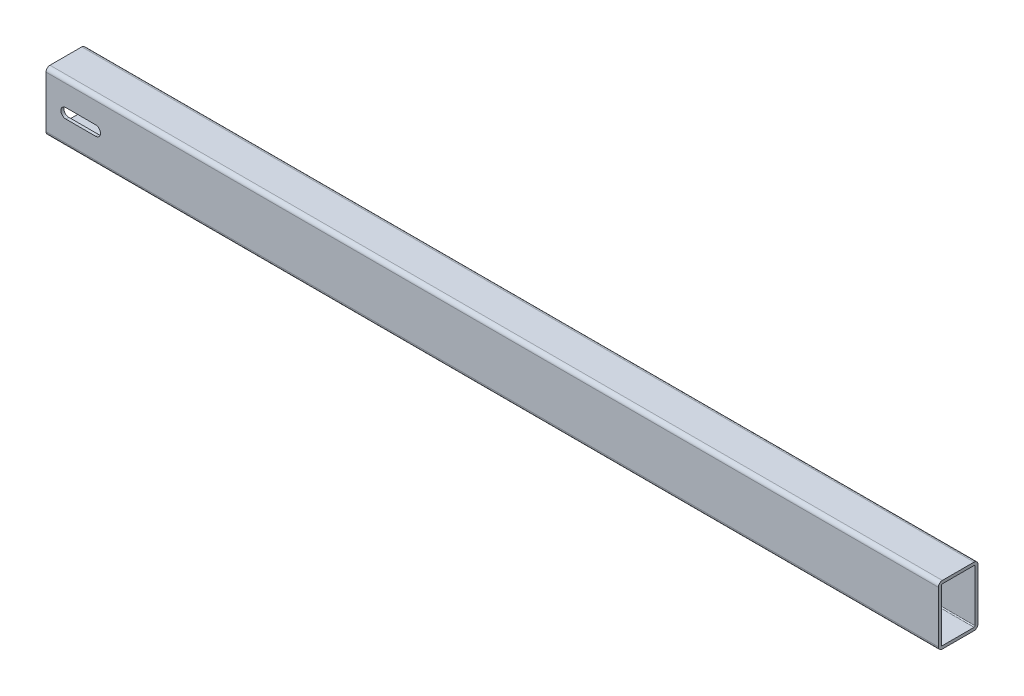
ISO-10303-21;
HEADER;
FILE_DESCRIPTION(('STEP AP214'),'2;1');
FILE_NAME('part.step','',(''),(''),'','','');
FILE_SCHEMA(('AUTOMOTIVE_DESIGN { 1 0 10303 214 1 1 1 1 }'));
ENDSEC;
DATA;
#1=APPLICATION_CONTEXT('core data for automotive mechanical design processes');
#2=APPLICATION_PROTOCOL_DEFINITION('international standard','automotive_design',2000,#1);
#3=PRODUCT_CONTEXT('',#1,'mechanical');
#4=PRODUCT('Part','Part','',(#3));
#5=PRODUCT_RELATED_PRODUCT_CATEGORY('part','',(#4));
#6=PRODUCT_DEFINITION_FORMATION('','',#4);
#7=PRODUCT_DEFINITION_CONTEXT('part definition',#1,'design');
#8=PRODUCT_DEFINITION('design','',#6,#7);
#9=PRODUCT_DEFINITION_SHAPE('','',#8);
#10=(LENGTH_UNIT() NAMED_UNIT(*) SI_UNIT(.MILLI.,.METRE.));
#11=(NAMED_UNIT(*) PLANE_ANGLE_UNIT() SI_UNIT($,.RADIAN.));
#12=(NAMED_UNIT(*) SI_UNIT($,.STERADIAN.) SOLID_ANGLE_UNIT());
#13=UNCERTAINTY_MEASURE_WITH_UNIT(LENGTH_MEASURE(1.E-05),#10,'distance_accuracy_value','');
#14=(GEOMETRIC_REPRESENTATION_CONTEXT(3) GLOBAL_UNCERTAINTY_ASSIGNED_CONTEXT((#13)) GLOBAL_UNIT_ASSIGNED_CONTEXT((#10,
#11,#12)) REPRESENTATION_CONTEXT('',''));
#15=CARTESIAN_POINT('',(0.,0.,0.));
#16=DIRECTION('',(0.,0.,1.));
#17=DIRECTION('',(1.,0.,0.));
#18=AXIS2_PLACEMENT_3D('',#15,#16,#17);
#19=CARTESIAN_POINT('',(900.,1.,-1.));
#20=DIRECTION('',(-1.,0.,0.));
#21=DIRECTION('',(0.,0.,1.));
#22=AXIS2_PLACEMENT_3D('',#19,#20,#21);
#23=PLANE('',#22);
#24=CARTESIAN_POINT('',(900.,1.,-1.));
#25=DIRECTION('',(-1.,0.,0.));
#26=DIRECTION('',(0.,0.,1.));
#27=AXIS2_PLACEMENT_3D('',#24,#25,#26);
#28=CIRCLE('',#27,4.);
#29=CARTESIAN_POINT('',(900.,1.,3.));
#30=VERTEX_POINT('',#29);
#31=CARTESIAN_POINT('',(900.,-3.,-1.));
#32=VERTEX_POINT('',#31);
#33=EDGE_CURVE('E358',#30,#32,#28,.F.);
#34=ORIENTED_EDGE('',*,*,#33,.T.);
#35=DIRECTION('',(0.,0.,-1.));
#36=VECTOR('',#35,1.);
#37=CARTESIAN_POINT('',(900.,-3.,-1.));
#38=LINE('',#37,#36);
#39=CARTESIAN_POINT('',(900.,-3.,-33.));
#40=VERTEX_POINT('',#39);
#41=EDGE_CURVE('E361',#32,#40,#38,.T.);
#42=ORIENTED_EDGE('',*,*,#41,.T.);
#43=CARTESIAN_POINT('',(900.,1.,-33.));
#44=DIRECTION('',(-1.,0.,0.));
#45=DIRECTION('',(0.,0.,1.));
#46=AXIS2_PLACEMENT_3D('',#43,#44,#45);
#47=CIRCLE('',#46,4.);
#48=CARTESIAN_POINT('',(900.,1.,-37.));
#49=VERTEX_POINT('',#48);
#50=EDGE_CURVE('E364',#40,#49,#47,.F.);
#51=ORIENTED_EDGE('',*,*,#50,.T.);
#52=DIRECTION('',(0.,1.,0.));
#53=VECTOR('',#52,1.);
#54=CARTESIAN_POINT('',(900.,1.,-37.));
#55=LINE('',#54,#53);
#56=CARTESIAN_POINT('',(900.,53.,-37.));
#57=VERTEX_POINT('',#56);
#58=EDGE_CURVE('E366',#49,#57,#55,.T.);
#59=ORIENTED_EDGE('',*,*,#58,.T.);
#60=CARTESIAN_POINT('',(900.,53.,-33.));
#61=DIRECTION('',(-1.,0.,0.));
#62=DIRECTION('',(0.,0.,1.));
#63=AXIS2_PLACEMENT_3D('',#60,#61,#62);
#64=CIRCLE('',#63,4.);
#65=CARTESIAN_POINT('',(900.,57.,-33.));
#66=VERTEX_POINT('',#65);
#67=EDGE_CURVE('E368',#57,#66,#64,.F.);
#68=ORIENTED_EDGE('',*,*,#67,.T.);
#69=DIRECTION('',(0.,0.,1.));
#70=VECTOR('',#69,1.);
#71=CARTESIAN_POINT('',(900.,57.,-1.));
#72=LINE('',#71,#70);
#73=CARTESIAN_POINT('',(900.,57.,-1.));
#74=VERTEX_POINT('',#73);
#75=EDGE_CURVE('E370',#66,#74,#72,.T.);
#76=ORIENTED_EDGE('',*,*,#75,.T.);
#77=CARTESIAN_POINT('',(900.,53.,-1.));
#78=DIRECTION('',(-1.,0.,0.));
#79=DIRECTION('',(0.,0.,1.));
#80=AXIS2_PLACEMENT_3D('',#77,#78,#79);
#81=CIRCLE('',#80,4.);
#82=CARTESIAN_POINT('',(900.,53.,3.));
#83=VERTEX_POINT('',#82);
#84=EDGE_CURVE('E372',#74,#83,#81,.F.);
#85=ORIENTED_EDGE('',*,*,#84,.T.);
#86=DIRECTION('',(0.,-1.,0.));
#87=VECTOR('',#86,1.);
#88=CARTESIAN_POINT('',(900.,1.,3.));
#89=LINE('',#88,#87);
#90=EDGE_CURVE('E374',#83,#30,#89,.T.);
#91=ORIENTED_EDGE('',*,*,#90,.T.);
#92=EDGE_LOOP('',(#34,#42,#51,#59,#68,#76,#85,#91));
#93=FACE_BOUND('',#92,.T.);
#94=CARTESIAN_POINT('',(900.,1.,-1.));
#95=DIRECTION('',(1.,0.,0.));
#96=DIRECTION('',(0.,0.,1.));
#97=AXIS2_PLACEMENT_3D('',#94,#95,#96);
#98=CIRCLE('',#97,1.);
#99=CARTESIAN_POINT('',(900.,1.,0.));
#100=VERTEX_POINT('',#99);
#101=CARTESIAN_POINT('',(900.,0.,-1.));
#102=VERTEX_POINT('',#101);
#103=EDGE_CURVE('E299',#100,#102,#98,.T.);
#104=ORIENTED_EDGE('',*,*,#103,.F.);
#105=DIRECTION('',(0.,-1.,0.));
#106=VECTOR('',#105,1.);
#107=CARTESIAN_POINT('',(900.,1.,0.));
#108=LINE('',#107,#106);
#109=CARTESIAN_POINT('',(900.,53.,0.));
#110=VERTEX_POINT('',#109);
#111=EDGE_CURVE('E315',#110,#100,#108,.T.);
#112=ORIENTED_EDGE('',*,*,#111,.F.);
#113=CARTESIAN_POINT('',(900.,53.,-1.));
#114=DIRECTION('',(1.,0.,0.));
#115=DIRECTION('',(0.,0.,1.));
#116=AXIS2_PLACEMENT_3D('',#113,#114,#115);
#117=CIRCLE('',#116,1.);
#118=CARTESIAN_POINT('',(900.,54.,-1.));
#119=VERTEX_POINT('',#118);
#120=EDGE_CURVE('E312',#119,#110,#117,.T.);
#121=ORIENTED_EDGE('',*,*,#120,.F.);
#122=DIRECTION('',(0.,0.,1.));
#123=VECTOR('',#122,1.);
#124=CARTESIAN_POINT('',(900.,54.,-1.));
#125=LINE('',#124,#123);
#126=CARTESIAN_POINT('',(900.,54.,-33.));
#127=VERTEX_POINT('',#126);
#128=EDGE_CURVE('E310',#127,#119,#125,.T.);
#129=ORIENTED_EDGE('',*,*,#128,.F.);
#130=CARTESIAN_POINT('',(900.,53.,-33.));
#131=DIRECTION('',(1.,0.,0.));
#132=DIRECTION('',(0.,0.,-1.));
#133=AXIS2_PLACEMENT_3D('',#130,#131,#132);
#134=CIRCLE('',#133,1.);
#135=CARTESIAN_POINT('',(900.,53.,-34.));
#136=VERTEX_POINT('',#135);
#137=EDGE_CURVE('E308',#136,#127,#134,.T.);
#138=ORIENTED_EDGE('',*,*,#137,.F.);
#139=DIRECTION('',(0.,1.,0.));
#140=VECTOR('',#139,1.);
#141=CARTESIAN_POINT('',(900.,1.,-34.));
#142=LINE('',#141,#140);
#143=CARTESIAN_POINT('',(900.,1.,-34.));
#144=VERTEX_POINT('',#143);
#145=EDGE_CURVE('E306',#144,#136,#142,.T.);
#146=ORIENTED_EDGE('',*,*,#145,.F.);
#147=CARTESIAN_POINT('',(900.,1.,-33.));
#148=DIRECTION('',(1.,0.,0.));
#149=DIRECTION('',(0.,0.,-1.));
#150=AXIS2_PLACEMENT_3D('',#147,#148,#149);
#151=CIRCLE('',#150,1.);
#152=CARTESIAN_POINT('',(900.,0.,-33.));
#153=VERTEX_POINT('',#152);
#154=EDGE_CURVE('E304',#153,#144,#151,.T.);
#155=ORIENTED_EDGE('',*,*,#154,.F.);
#156=DIRECTION('',(0.,0.,-1.));
#157=VECTOR('',#156,1.);
#158=CARTESIAN_POINT('',(900.,0.,-1.));
#159=LINE('',#158,#157);
#160=EDGE_CURVE('E301',#102,#153,#159,.T.);
#161=ORIENTED_EDGE('',*,*,#160,.F.);
#162=EDGE_LOOP('',(#104,#112,#121,#129,#138,#146,#155,#161));
#163=FACE_BOUND('',#162,.T.);
#164=ADVANCED_FACE('F83',(#93,#163),#23,.F.);
#165=CARTESIAN_POINT('',(0.,1.,-1.));
#166=DIRECTION('',(-1.,0.,0.));
#167=DIRECTION('',(0.,0.,1.));
#168=AXIS2_PLACEMENT_3D('',#165,#166,#167);
#169=PLANE('',#168);
#170=CARTESIAN_POINT('',(0.,1.,-1.));
#171=DIRECTION('',(-1.,0.,0.));
#172=DIRECTION('',(0.,0.,1.));
#173=AXIS2_PLACEMENT_3D('',#170,#171,#172);
#174=CIRCLE('',#173,4.);
#175=CARTESIAN_POINT('',(0.,1.,3.));
#176=VERTEX_POINT('',#175);
#177=CARTESIAN_POINT('',(0.,-3.,-1.));
#178=VERTEX_POINT('',#177);
#179=EDGE_CURVE('E357',#176,#178,#174,.F.);
#180=ORIENTED_EDGE('',*,*,#179,.F.);
#181=DIRECTION('',(0.,-1.,0.));
#182=VECTOR('',#181,1.);
#183=CARTESIAN_POINT('',(0.,1.,3.));
#184=LINE('',#183,#182);
#185=CARTESIAN_POINT('',(0.,53.,3.));
#186=VERTEX_POINT('',#185);
#187=EDGE_CURVE('E362',#186,#176,#184,.T.);
#188=ORIENTED_EDGE('',*,*,#187,.F.);
#189=CARTESIAN_POINT('',(0.,53.,-1.));
#190=DIRECTION('',(-1.,0.,0.));
#191=DIRECTION('',(0.,0.,1.));
#192=AXIS2_PLACEMENT_3D('',#189,#190,#191);
#193=CIRCLE('',#192,4.);
#194=CARTESIAN_POINT('',(0.,57.,-1.));
#195=VERTEX_POINT('',#194);
#196=EDGE_CURVE('E389',#195,#186,#193,.F.);
#197=ORIENTED_EDGE('',*,*,#196,.F.);
#198=DIRECTION('',(0.,0.,1.));
#199=VECTOR('',#198,1.);
#200=CARTESIAN_POINT('',(0.,57.,-1.));
#201=LINE('',#200,#199);
#202=CARTESIAN_POINT('',(0.,57.,-33.));
#203=VERTEX_POINT('',#202);
#204=EDGE_CURVE('E387',#203,#195,#201,.T.);
#205=ORIENTED_EDGE('',*,*,#204,.F.);
#206=CARTESIAN_POINT('',(0.,53.,-33.));
#207=DIRECTION('',(-1.,0.,0.));
#208=DIRECTION('',(0.,0.,1.));
#209=AXIS2_PLACEMENT_3D('',#206,#207,#208);
#210=CIRCLE('',#209,4.);
#211=CARTESIAN_POINT('',(0.,53.,-37.));
#212=VERTEX_POINT('',#211);
#213=EDGE_CURVE('E385',#212,#203,#210,.F.);
#214=ORIENTED_EDGE('',*,*,#213,.F.);
#215=DIRECTION('',(0.,1.,0.));
#216=VECTOR('',#215,1.);
#217=CARTESIAN_POINT('',(0.,1.,-37.));
#218=LINE('',#217,#216);
#219=CARTESIAN_POINT('',(0.,1.,-37.));
#220=VERTEX_POINT('',#219);
#221=EDGE_CURVE('E383',#220,#212,#218,.T.);
#222=ORIENTED_EDGE('',*,*,#221,.F.);
#223=CARTESIAN_POINT('',(0.,1.,-33.));
#224=DIRECTION('',(-1.,0.,0.));
#225=DIRECTION('',(0.,0.,1.));
#226=AXIS2_PLACEMENT_3D('',#223,#224,#225);
#227=CIRCLE('',#226,4.);
#228=CARTESIAN_POINT('',(0.,-3.,-33.));
#229=VERTEX_POINT('',#228);
#230=EDGE_CURVE('E381',#229,#220,#227,.F.);
#231=ORIENTED_EDGE('',*,*,#230,.F.);
#232=DIRECTION('',(0.,0.,-1.));
#233=VECTOR('',#232,1.);
#234=CARTESIAN_POINT('',(0.,-3.,-1.));
#235=LINE('',#234,#233);
#236=EDGE_CURVE('E379',#178,#229,#235,.T.);
#237=ORIENTED_EDGE('',*,*,#236,.F.);
#238=EDGE_LOOP('',(#180,#188,#197,#205,#214,#222,#231,#237));
#239=FACE_BOUND('',#238,.T.);
#240=DIRECTION('',(0.,-1.,0.));
#241=VECTOR('',#240,1.);
#242=CARTESIAN_POINT('',(0.,1.,0.));
#243=LINE('',#242,#241);
#244=CARTESIAN_POINT('',(0.,53.,0.));
#245=VERTEX_POINT('',#244);
#246=CARTESIAN_POINT('',(0.,1.,0.));
#247=VERTEX_POINT('',#246);
#248=EDGE_CURVE('E302',#245,#247,#243,.T.);
#249=ORIENTED_EDGE('',*,*,#248,.T.);
#250=CARTESIAN_POINT('',(0.,1.,-1.));
#251=DIRECTION('',(1.,0.,0.));
#252=DIRECTION('',(0.,0.,1.));
#253=AXIS2_PLACEMENT_3D('',#250,#251,#252);
#254=CIRCLE('',#253,1.);
#255=CARTESIAN_POINT('',(0.,0.,-1.));
#256=VERTEX_POINT('',#255);
#257=EDGE_CURVE('E298',#247,#256,#254,.T.);
#258=ORIENTED_EDGE('',*,*,#257,.T.);
#259=DIRECTION('',(0.,0.,-1.));
#260=VECTOR('',#259,1.);
#261=CARTESIAN_POINT('',(0.,0.,-1.));
#262=LINE('',#261,#260);
#263=CARTESIAN_POINT('',(0.,0.,-33.));
#264=VERTEX_POINT('',#263);
#265=EDGE_CURVE('E320',#256,#264,#262,.T.);
#266=ORIENTED_EDGE('',*,*,#265,.T.);
#267=CARTESIAN_POINT('',(0.,1.,-33.));
#268=DIRECTION('',(1.,0.,0.));
#269=DIRECTION('',(0.,0.,-1.));
#270=AXIS2_PLACEMENT_3D('',#267,#268,#269);
#271=CIRCLE('',#270,1.);
#272=CARTESIAN_POINT('',(0.,1.,-34.));
#273=VERTEX_POINT('',#272);
#274=EDGE_CURVE('E323',#264,#273,#271,.T.);
#275=ORIENTED_EDGE('',*,*,#274,.T.);
#276=DIRECTION('',(0.,1.,0.));
#277=VECTOR('',#276,1.);
#278=CARTESIAN_POINT('',(0.,1.,-34.));
#279=LINE('',#278,#277);
#280=CARTESIAN_POINT('',(0.,53.,-34.));
#281=VERTEX_POINT('',#280);
#282=EDGE_CURVE('E326',#273,#281,#279,.T.);
#283=ORIENTED_EDGE('',*,*,#282,.T.);
#284=CARTESIAN_POINT('',(0.,53.,-33.));
#285=DIRECTION('',(1.,0.,0.));
#286=DIRECTION('',(0.,0.,-1.));
#287=AXIS2_PLACEMENT_3D('',#284,#285,#286);
#288=CIRCLE('',#287,1.);
#289=CARTESIAN_POINT('',(0.,54.,-33.));
#290=VERTEX_POINT('',#289);
#291=EDGE_CURVE('E329',#281,#290,#288,.T.);
#292=ORIENTED_EDGE('',*,*,#291,.T.);
#293=DIRECTION('',(0.,0.,1.));
#294=VECTOR('',#293,1.);
#295=CARTESIAN_POINT('',(0.,54.,-1.));
#296=LINE('',#295,#294);
#297=CARTESIAN_POINT('',(0.,54.,-1.));
#298=VERTEX_POINT('',#297);
#299=EDGE_CURVE('E332',#290,#298,#296,.T.);
#300=ORIENTED_EDGE('',*,*,#299,.T.);
#301=CARTESIAN_POINT('',(0.,53.,-1.));
#302=DIRECTION('',(1.,0.,0.));
#303=DIRECTION('',(0.,0.,1.));
#304=AXIS2_PLACEMENT_3D('',#301,#302,#303);
#305=CIRCLE('',#304,1.);
#306=EDGE_CURVE('E335',#298,#245,#305,.T.);
#307=ORIENTED_EDGE('',*,*,#306,.T.);
#308=EDGE_LOOP('',(#249,#258,#266,#275,#283,#292,#300,#307));
#309=FACE_BOUND('',#308,.T.);
#310=ADVANCED_FACE('F455',(#239,#309),#169,.T.);
#311=CARTESIAN_POINT('',(900.,1.,-1.));
#312=DIRECTION('',(-1.,0.,0.));
#313=DIRECTION('',(0.,0.,1.));
#314=AXIS2_PLACEMENT_3D('',#311,#312,#313);
#315=CYLINDRICAL_SURFACE('',#314,4.);
#316=ORIENTED_EDGE('',*,*,#179,.T.);
#317=DIRECTION('',(-1.,0.,0.));
#318=VECTOR('',#317,1.);
#319=CARTESIAN_POINT('',(900.,-3.,-1.));
#320=LINE('',#319,#318);
#321=EDGE_CURVE('E412',#32,#178,#320,.T.);
#322=ORIENTED_EDGE('',*,*,#321,.F.);
#323=ORIENTED_EDGE('',*,*,#33,.F.);
#324=DIRECTION('',(-1.,0.,0.));
#325=VECTOR('',#324,1.);
#326=CARTESIAN_POINT('',(900.,1.,3.));
#327=LINE('',#326,#325);
#328=EDGE_CURVE('E376',#30,#176,#327,.T.);
#329=ORIENTED_EDGE('',*,*,#328,.T.);
#330=EDGE_LOOP('',(#316,#322,#323,#329));
#331=FACE_BOUND('',#330,.T.);
#332=ADVANCED_FACE('F85',(#331),#315,.T.);
#333=CARTESIAN_POINT('',(900.,-3.,-1.));
#334=DIRECTION('',(0.,1.,0.));
#335=DIRECTION('',(0.,0.,1.));
#336=AXIS2_PLACEMENT_3D('',#333,#334,#335);
#337=PLANE('',#336);
#338=ORIENTED_EDGE('',*,*,#236,.T.);
#339=DIRECTION('',(-1.,0.,0.));
#340=VECTOR('',#339,1.);
#341=CARTESIAN_POINT('',(900.,-3.,-33.));
#342=LINE('',#341,#340);
#343=EDGE_CURVE('E409',#40,#229,#342,.T.);
#344=ORIENTED_EDGE('',*,*,#343,.F.);
#345=ORIENTED_EDGE('',*,*,#41,.F.);
#346=ORIENTED_EDGE('',*,*,#321,.T.);
#347=EDGE_LOOP('',(#338,#344,#345,#346));
#348=FACE_BOUND('',#347,.T.);
#349=ADVANCED_FACE('F461',(#348),#337,.F.);
#350=CARTESIAN_POINT('',(900.,1.,-33.));
#351=DIRECTION('',(-1.,0.,0.));
#352=DIRECTION('',(0.,0.,1.));
#353=AXIS2_PLACEMENT_3D('',#350,#351,#352);
#354=CYLINDRICAL_SURFACE('',#353,4.);
#355=ORIENTED_EDGE('',*,*,#230,.T.);
#356=DIRECTION('',(-1.,0.,0.));
#357=VECTOR('',#356,1.);
#358=CARTESIAN_POINT('',(900.,1.,-37.));
#359=LINE('',#358,#357);
#360=EDGE_CURVE('E406',#49,#220,#359,.T.);
#361=ORIENTED_EDGE('',*,*,#360,.F.);
#362=ORIENTED_EDGE('',*,*,#50,.F.);
#363=ORIENTED_EDGE('',*,*,#343,.T.);
#364=EDGE_LOOP('',(#355,#361,#362,#363));
#365=FACE_BOUND('',#364,.T.);
#366=ADVANCED_FACE('F481',(#365),#354,.T.);
#367=CARTESIAN_POINT('',(900.,1.,-37.));
#368=DIRECTION('',(0.,0.,1.));
#369=DIRECTION('',(1.,0.,0.));
#370=AXIS2_PLACEMENT_3D('',#367,#368,#369);
#371=PLANE('',#370);
#372=DIRECTION('',(-1.,0.,0.));
#373=VECTOR('',#372,1.);
#374=CARTESIAN_POINT('',(20.,32.,-37.));
#375=LINE('',#374,#373);
#376=CARTESIAN_POINT('',(50.,32.,-37.));
#377=VERTEX_POINT('',#376);
#378=CARTESIAN_POINT('',(20.,32.,-37.));
#379=VERTEX_POINT('',#378);
#380=EDGE_CURVE('E268',#377,#379,#375,.T.);
#381=ORIENTED_EDGE('',*,*,#380,.T.);
#382=CARTESIAN_POINT('',(20.,27.,-37.));
#383=DIRECTION('',(0.,0.,1.));
#384=DIRECTION('',(-1.,0.,0.));
#385=AXIS2_PLACEMENT_3D('',#382,#383,#384);
#386=CIRCLE('',#385,5.);
#387=CARTESIAN_POINT('',(20.,22.,-37.));
#388=VERTEX_POINT('',#387);
#389=EDGE_CURVE('E250',#379,#388,#386,.T.);
#390=ORIENTED_EDGE('',*,*,#389,.T.);
#391=DIRECTION('',(1.,0.,0.));
#392=VECTOR('',#391,1.);
#393=CARTESIAN_POINT('',(20.,22.,-37.));
#394=LINE('',#393,#392);
#395=CARTESIAN_POINT('',(49.9999999999999,22.,-37.));
#396=VERTEX_POINT('',#395);
#397=EDGE_CURVE('E260',#388,#396,#394,.T.);
#398=ORIENTED_EDGE('',*,*,#397,.T.);
#399=CARTESIAN_POINT('',(50.,27.,-37.));
#400=DIRECTION('',(0.,0.,1.));
#401=DIRECTION('',(-1.,0.,0.));
#402=AXIS2_PLACEMENT_3D('',#399,#400,#401);
#403=CIRCLE('',#402,5.);
#404=EDGE_CURVE('E98',#396,#377,#403,.T.);
#405=ORIENTED_EDGE('',*,*,#404,.T.);
#406=EDGE_LOOP('',(#381,#390,#398,#405));
#407=FACE_BOUND('',#406,.T.);
#408=ORIENTED_EDGE('',*,*,#221,.T.);
#409=DIRECTION('',(-1.,0.,0.));
#410=VECTOR('',#409,1.);
#411=CARTESIAN_POINT('',(900.,53.,-37.));
#412=LINE('',#411,#410);
#413=EDGE_CURVE('E403',#57,#212,#412,.T.);
#414=ORIENTED_EDGE('',*,*,#413,.F.);
#415=ORIENTED_EDGE('',*,*,#58,.F.);
#416=ORIENTED_EDGE('',*,*,#360,.T.);
#417=EDGE_LOOP('',(#408,#414,#415,#416));
#418=FACE_BOUND('',#417,.T.);
#419=ADVANCED_FACE('F265',(#407,#418),#371,.F.);
#420=CARTESIAN_POINT('',(900.,53.,-33.));
#421=DIRECTION('',(-1.,0.,0.));
#422=DIRECTION('',(0.,0.,1.));
#423=AXIS2_PLACEMENT_3D('',#420,#421,#422);
#424=CYLINDRICAL_SURFACE('',#423,4.);
#425=ORIENTED_EDGE('',*,*,#213,.T.);
#426=DIRECTION('',(-1.,0.,0.));
#427=VECTOR('',#426,1.);
#428=CARTESIAN_POINT('',(900.,57.,-33.));
#429=LINE('',#428,#427);
#430=EDGE_CURVE('E400',#66,#203,#429,.T.);
#431=ORIENTED_EDGE('',*,*,#430,.F.);
#432=ORIENTED_EDGE('',*,*,#67,.F.);
#433=ORIENTED_EDGE('',*,*,#413,.T.);
#434=EDGE_LOOP('',(#425,#431,#432,#433));
#435=FACE_BOUND('',#434,.T.);
#436=ADVANCED_FACE('F476',(#435),#424,.T.);
#437=CARTESIAN_POINT('',(900.,57.,-1.));
#438=DIRECTION('',(0.,-1.,0.));
#439=DIRECTION('',(0.,0.,-1.));
#440=AXIS2_PLACEMENT_3D('',#437,#438,#439);
#441=PLANE('',#440);
#442=ORIENTED_EDGE('',*,*,#204,.T.);
#443=DIRECTION('',(-1.,0.,0.));
#444=VECTOR('',#443,1.);
#445=CARTESIAN_POINT('',(900.,57.,-1.));
#446=LINE('',#445,#444);
#447=EDGE_CURVE('E397',#74,#195,#446,.T.);
#448=ORIENTED_EDGE('',*,*,#447,.F.);
#449=ORIENTED_EDGE('',*,*,#75,.F.);
#450=ORIENTED_EDGE('',*,*,#430,.T.);
#451=EDGE_LOOP('',(#442,#448,#449,#450));
#452=FACE_BOUND('',#451,.T.);
#453=ADVANCED_FACE('F472',(#452),#441,.F.);
#454=CARTESIAN_POINT('',(900.,53.,-1.));
#455=DIRECTION('',(-1.,0.,0.));
#456=DIRECTION('',(0.,0.,1.));
#457=AXIS2_PLACEMENT_3D('',#454,#455,#456);
#458=CYLINDRICAL_SURFACE('',#457,4.);
#459=ORIENTED_EDGE('',*,*,#196,.T.);
#460=DIRECTION('',(-1.,0.,0.));
#461=VECTOR('',#460,1.);
#462=CARTESIAN_POINT('',(900.,53.,3.));
#463=LINE('',#462,#461);
#464=EDGE_CURVE('E394',#83,#186,#463,.T.);
#465=ORIENTED_EDGE('',*,*,#464,.F.);
#466=ORIENTED_EDGE('',*,*,#84,.F.);
#467=ORIENTED_EDGE('',*,*,#447,.T.);
#468=EDGE_LOOP('',(#459,#465,#466,#467));
#469=FACE_BOUND('',#468,.T.);
#470=ADVANCED_FACE('F443',(#469),#458,.T.);
#471=CARTESIAN_POINT('',(900.,1.,3.));
#472=DIRECTION('',(0.,0.,-1.));
#473=DIRECTION('',(-1.,0.,0.));
#474=AXIS2_PLACEMENT_3D('',#471,#472,#473);
#475=PLANE('',#474);
#476=DIRECTION('',(1.,0.,0.));
#477=VECTOR('',#476,1.);
#478=CARTESIAN_POINT('',(20.,22.,3.));
#479=LINE('',#478,#477);
#480=CARTESIAN_POINT('',(20.,22.,3.));
#481=VERTEX_POINT('',#480);
#482=CARTESIAN_POINT('',(50.,22.,3.));
#483=VERTEX_POINT('',#482);
#484=EDGE_CURVE('E278',#481,#483,#479,.T.);
#485=ORIENTED_EDGE('',*,*,#484,.F.);
#486=CARTESIAN_POINT('',(20.,27.,3.));
#487=DIRECTION('',(0.,0.,1.));
#488=DIRECTION('',(-1.,0.,0.));
#489=AXIS2_PLACEMENT_3D('',#486,#487,#488);
#490=CIRCLE('',#489,5.);
#491=CARTESIAN_POINT('',(20.,32.,3.));
#492=VERTEX_POINT('',#491);
#493=EDGE_CURVE('E106',#492,#481,#490,.T.);
#494=ORIENTED_EDGE('',*,*,#493,.F.);
#495=DIRECTION('',(-1.,0.,0.));
#496=VECTOR('',#495,1.);
#497=CARTESIAN_POINT('',(20.,32.,3.));
#498=LINE('',#497,#496);
#499=CARTESIAN_POINT('',(50.,32.,3.));
#500=VERTEX_POINT('',#499);
#501=EDGE_CURVE('E269',#500,#492,#498,.T.);
#502=ORIENTED_EDGE('',*,*,#501,.F.);
#503=CARTESIAN_POINT('',(50.,27.,3.));
#504=DIRECTION('',(0.,0.,1.));
#505=DIRECTION('',(-1.,0.,0.));
#506=AXIS2_PLACEMENT_3D('',#503,#504,#505);
#507=CIRCLE('',#506,5.);
#508=EDGE_CURVE('E272',#483,#500,#507,.T.);
#509=ORIENTED_EDGE('',*,*,#508,.F.);
#510=EDGE_LOOP('',(#485,#494,#502,#509));
#511=FACE_BOUND('',#510,.T.);
#512=ORIENTED_EDGE('',*,*,#187,.T.);
#513=ORIENTED_EDGE('',*,*,#328,.F.);
#514=ORIENTED_EDGE('',*,*,#90,.F.);
#515=ORIENTED_EDGE('',*,*,#464,.T.);
#516=EDGE_LOOP('',(#512,#513,#514,#515));
#517=FACE_BOUND('',#516,.T.);
#518=ADVANCED_FACE('F439',(#511,#517),#475,.F.);
#519=CARTESIAN_POINT('',(900.,1.,-1.));
#520=DIRECTION('',(-1.,0.,0.));
#521=DIRECTION('',(0.,0.,1.));
#522=AXIS2_PLACEMENT_3D('',#519,#520,#521);
#523=CYLINDRICAL_SURFACE('',#522,1.);
#524=ORIENTED_EDGE('',*,*,#257,.F.);
#525=DIRECTION('',(-1.,0.,0.));
#526=VECTOR('',#525,1.);
#527=CARTESIAN_POINT('',(900.,1.,0.));
#528=LINE('',#527,#526);
#529=EDGE_CURVE('E317',#100,#247,#528,.T.);
#530=ORIENTED_EDGE('',*,*,#529,.F.);
#531=ORIENTED_EDGE('',*,*,#103,.T.);
#532=DIRECTION('',(-1.,0.,0.));
#533=VECTOR('',#532,1.);
#534=CARTESIAN_POINT('',(900.,0.,-1.));
#535=LINE('',#534,#533);
#536=EDGE_CURVE('E354',#102,#256,#535,.T.);
#537=ORIENTED_EDGE('',*,*,#536,.T.);
#538=EDGE_LOOP('',(#524,#530,#531,#537));
#539=FACE_BOUND('',#538,.T.);
#540=ADVANCED_FACE('F442',(#539),#523,.F.);
#541=CARTESIAN_POINT('',(900.,0.,-1.));
#542=DIRECTION('',(0.,1.,0.));
#543=DIRECTION('',(0.,0.,1.));
#544=AXIS2_PLACEMENT_3D('',#541,#542,#543);
#545=PLANE('',#544);
#546=ORIENTED_EDGE('',*,*,#265,.F.);
#547=ORIENTED_EDGE('',*,*,#536,.F.);
#548=ORIENTED_EDGE('',*,*,#160,.T.);
#549=DIRECTION('',(-1.,0.,0.));
#550=VECTOR('',#549,1.);
#551=CARTESIAN_POINT('',(900.,0.,-33.));
#552=LINE('',#551,#550);
#553=EDGE_CURVE('E352',#153,#264,#552,.T.);
#554=ORIENTED_EDGE('',*,*,#553,.T.);
#555=EDGE_LOOP('',(#546,#547,#548,#554));
#556=FACE_BOUND('',#555,.T.);
#557=ADVANCED_FACE('F526',(#556),#545,.T.);
#558=CARTESIAN_POINT('',(900.,1.,-33.));
#559=DIRECTION('',(-1.,0.,0.));
#560=DIRECTION('',(0.,0.,1.));
#561=AXIS2_PLACEMENT_3D('',#558,#559,#560);
#562=CYLINDRICAL_SURFACE('',#561,1.);
#563=ORIENTED_EDGE('',*,*,#274,.F.);
#564=ORIENTED_EDGE('',*,*,#553,.F.);
#565=ORIENTED_EDGE('',*,*,#154,.T.);
#566=DIRECTION('',(-1.,0.,0.));
#567=VECTOR('',#566,1.);
#568=CARTESIAN_POINT('',(900.,1.,-34.));
#569=LINE('',#568,#567);
#570=EDGE_CURVE('E350',#144,#273,#569,.T.);
#571=ORIENTED_EDGE('',*,*,#570,.T.);
#572=EDGE_LOOP('',(#563,#564,#565,#571));
#573=FACE_BOUND('',#572,.T.);
#574=ADVANCED_FACE('F533',(#573),#562,.F.);
#575=CARTESIAN_POINT('',(900.,1.,-34.));
#576=DIRECTION('',(0.,0.,1.));
#577=DIRECTION('',(1.,0.,0.));
#578=AXIS2_PLACEMENT_3D('',#575,#576,#577);
#579=PLANE('',#578);
#580=CARTESIAN_POINT('',(20.,27.,-34.));
#581=DIRECTION('',(0.,0.,1.));
#582=DIRECTION('',(1.,0.,0.));
#583=AXIS2_PLACEMENT_3D('',#580,#581,#582);
#584=CIRCLE('',#583,5.);
#585=CARTESIAN_POINT('',(20.,32.,-34.));
#586=VERTEX_POINT('',#585);
#587=CARTESIAN_POINT('',(20.,22.,-34.));
#588=VERTEX_POINT('',#587);
#589=EDGE_CURVE('E253',#586,#588,#584,.T.);
#590=ORIENTED_EDGE('',*,*,#589,.F.);
#591=DIRECTION('',(-1.,0.,0.));
#592=VECTOR('',#591,1.);
#593=CARTESIAN_POINT('',(900.,31.9999999999998,-34.));
#594=LINE('',#593,#592);
#595=CARTESIAN_POINT('',(50.,32.,-34.));
#596=VERTEX_POINT('',#595);
#597=EDGE_CURVE('E295',#596,#586,#594,.T.);
#598=ORIENTED_EDGE('',*,*,#597,.F.);
#599=CARTESIAN_POINT('',(50.,27.,-34.));
#600=DIRECTION('',(0.,0.,1.));
#601=DIRECTION('',(1.,0.,0.));
#602=AXIS2_PLACEMENT_3D('',#599,#600,#601);
#603=CIRCLE('',#602,5.);
#604=CARTESIAN_POINT('',(50.,22.,-34.));
#605=VERTEX_POINT('',#604);
#606=EDGE_CURVE('E293',#605,#596,#603,.T.);
#607=ORIENTED_EDGE('',*,*,#606,.F.);
#608=DIRECTION('',(1.,0.,0.));
#609=VECTOR('',#608,1.);
#610=CARTESIAN_POINT('',(900.,22.,-34.));
#611=LINE('',#610,#609);
#612=EDGE_CURVE('E285',#588,#605,#611,.T.);
#613=ORIENTED_EDGE('',*,*,#612,.F.);
#614=EDGE_LOOP('',(#590,#598,#607,#613));
#615=FACE_BOUND('',#614,.T.);
#616=ORIENTED_EDGE('',*,*,#282,.F.);
#617=ORIENTED_EDGE('',*,*,#570,.F.);
#618=ORIENTED_EDGE('',*,*,#145,.T.);
#619=DIRECTION('',(-1.,0.,0.));
#620=VECTOR('',#619,1.);
#621=CARTESIAN_POINT('',(900.,53.,-34.));
#622=LINE('',#621,#620);
#623=EDGE_CURVE('E348',#136,#281,#622,.T.);
#624=ORIENTED_EDGE('',*,*,#623,.T.);
#625=EDGE_LOOP('',(#616,#617,#618,#624));
#626=FACE_BOUND('',#625,.T.);
#627=ADVANCED_FACE('F540',(#615,#626),#579,.T.);
#628=CARTESIAN_POINT('',(900.,53.,-33.));
#629=DIRECTION('',(-1.,0.,0.));
#630=DIRECTION('',(0.,0.,1.));
#631=AXIS2_PLACEMENT_3D('',#628,#629,#630);
#632=CYLINDRICAL_SURFACE('',#631,1.);
#633=ORIENTED_EDGE('',*,*,#291,.F.);
#634=ORIENTED_EDGE('',*,*,#623,.F.);
#635=ORIENTED_EDGE('',*,*,#137,.T.);
#636=DIRECTION('',(-1.,0.,0.));
#637=VECTOR('',#636,1.);
#638=CARTESIAN_POINT('',(900.,54.,-33.));
#639=LINE('',#638,#637);
#640=EDGE_CURVE('E346',#127,#290,#639,.T.);
#641=ORIENTED_EDGE('',*,*,#640,.T.);
#642=EDGE_LOOP('',(#633,#634,#635,#641));
#643=FACE_BOUND('',#642,.T.);
#644=ADVANCED_FACE('F548',(#643),#632,.F.);
#645=CARTESIAN_POINT('',(900.,54.,-1.));
#646=DIRECTION('',(0.,-1.,0.));
#647=DIRECTION('',(0.,0.,-1.));
#648=AXIS2_PLACEMENT_3D('',#645,#646,#647);
#649=PLANE('',#648);
#650=ORIENTED_EDGE('',*,*,#299,.F.);
#651=ORIENTED_EDGE('',*,*,#640,.F.);
#652=ORIENTED_EDGE('',*,*,#128,.T.);
#653=DIRECTION('',(-1.,0.,0.));
#654=VECTOR('',#653,1.);
#655=CARTESIAN_POINT('',(900.,54.,-1.));
#656=LINE('',#655,#654);
#657=EDGE_CURVE('E344',#119,#298,#656,.T.);
#658=ORIENTED_EDGE('',*,*,#657,.T.);
#659=EDGE_LOOP('',(#650,#651,#652,#658));
#660=FACE_BOUND('',#659,.T.);
#661=ADVANCED_FACE('F556',(#660),#649,.T.);
#662=CARTESIAN_POINT('',(900.,53.,-1.));
#663=DIRECTION('',(-1.,0.,0.));
#664=DIRECTION('',(0.,0.,1.));
#665=AXIS2_PLACEMENT_3D('',#662,#663,#664);
#666=CYLINDRICAL_SURFACE('',#665,1.);
#667=ORIENTED_EDGE('',*,*,#306,.F.);
#668=ORIENTED_EDGE('',*,*,#657,.F.);
#669=ORIENTED_EDGE('',*,*,#120,.T.);
#670=DIRECTION('',(-1.,0.,0.));
#671=VECTOR('',#670,1.);
#672=CARTESIAN_POINT('',(900.,53.,0.));
#673=LINE('',#672,#671);
#674=EDGE_CURVE('E342',#110,#245,#673,.T.);
#675=ORIENTED_EDGE('',*,*,#674,.T.);
#676=EDGE_LOOP('',(#667,#668,#669,#675));
#677=FACE_BOUND('',#676,.T.);
#678=ADVANCED_FACE('F564',(#677),#666,.F.);
#679=CARTESIAN_POINT('',(900.,1.,0.));
#680=DIRECTION('',(0.,0.,-1.));
#681=DIRECTION('',(-1.,0.,0.));
#682=AXIS2_PLACEMENT_3D('',#679,#680,#681);
#683=PLANE('',#682);
#684=CARTESIAN_POINT('',(20.,27.,0.));
#685=DIRECTION('',(0.,0.,-1.));
#686=DIRECTION('',(-1.,0.,0.));
#687=AXIS2_PLACEMENT_3D('',#684,#685,#686);
#688=CIRCLE('',#687,5.);
#689=CARTESIAN_POINT('',(20.,22.,0.));
#690=VERTEX_POINT('',#689);
#691=CARTESIAN_POINT('',(20.,32.,0.));
#692=VERTEX_POINT('',#691);
#693=EDGE_CURVE('E12',#690,#692,#688,.T.);
#694=ORIENTED_EDGE('',*,*,#693,.F.);
#695=DIRECTION('',(-1.,0.,0.));
#696=VECTOR('',#695,1.);
#697=CARTESIAN_POINT('',(900.,22.,0.));
#698=LINE('',#697,#696);
#699=CARTESIAN_POINT('',(49.9999999999999,22.,0.));
#700=VERTEX_POINT('',#699);
#701=EDGE_CURVE('E415',#700,#690,#698,.T.);
#702=ORIENTED_EDGE('',*,*,#701,.F.);
#703=CARTESIAN_POINT('',(50.,27.,0.));
#704=DIRECTION('',(0.,0.,-1.));
#705=DIRECTION('',(-1.,0.,0.));
#706=AXIS2_PLACEMENT_3D('',#703,#704,#705);
#707=CIRCLE('',#706,5.);
#708=CARTESIAN_POINT('',(50.,32.,0.));
#709=VERTEX_POINT('',#708);
#710=EDGE_CURVE('E417',#709,#700,#707,.T.);
#711=ORIENTED_EDGE('',*,*,#710,.F.);
#712=DIRECTION('',(1.,0.,0.));
#713=VECTOR('',#712,1.);
#714=CARTESIAN_POINT('',(900.,31.9999999999998,0.));
#715=LINE('',#714,#713);
#716=EDGE_CURVE('E91',#692,#709,#715,.T.);
#717=ORIENTED_EDGE('',*,*,#716,.F.);
#718=EDGE_LOOP('',(#694,#702,#711,#717));
#719=FACE_BOUND('',#718,.T.);
#720=ORIENTED_EDGE('',*,*,#248,.F.);
#721=ORIENTED_EDGE('',*,*,#674,.F.);
#722=ORIENTED_EDGE('',*,*,#111,.T.);
#723=ORIENTED_EDGE('',*,*,#529,.T.);
#724=EDGE_LOOP('',(#720,#721,#722,#723));
#725=FACE_BOUND('',#724,.T.);
#726=ADVANCED_FACE('F432',(#719,#725),#683,.T.);
#727=CARTESIAN_POINT('',(20.,22.,-37.));
#728=DIRECTION('',(0.,-1.,0.));
#729=DIRECTION('',(0.,0.,-1.));
#730=AXIS2_PLACEMENT_3D('',#727,#728,#729);
#731=PLANE('',#730);
#732=ORIENTED_EDGE('',*,*,#701,.T.);
#733=DIRECTION('',(0.,0.,1.));
#734=VECTOR('',#733,1.);
#735=CARTESIAN_POINT('',(20.,22.,-37.));
#736=LINE('',#735,#734);
#737=EDGE_CURVE('E257',#690,#481,#736,.T.);
#738=ORIENTED_EDGE('',*,*,#737,.T.);
#739=ORIENTED_EDGE('',*,*,#484,.T.);
#740=DIRECTION('',(0.,0.,1.));
#741=VECTOR('',#740,1.);
#742=CARTESIAN_POINT('',(50.,22.,-37.));
#743=LINE('',#742,#741);
#744=EDGE_CURVE('E256',#700,#483,#743,.T.);
#745=ORIENTED_EDGE('',*,*,#744,.F.);
#746=EDGE_LOOP('',(#732,#738,#739,#745));
#747=FACE_BOUND('',#746,.T.);
#748=ADVANCED_FACE('F435',(#747),#731,.F.);
#749=CARTESIAN_POINT('',(50.,27.,-37.));
#750=DIRECTION('',(0.,0.,1.));
#751=DIRECTION('',(1.,0.,0.));
#752=AXIS2_PLACEMENT_3D('',#749,#750,#751);
#753=CYLINDRICAL_SURFACE('',#752,5.);
#754=ORIENTED_EDGE('',*,*,#710,.T.);
#755=ORIENTED_EDGE('',*,*,#744,.T.);
#756=ORIENTED_EDGE('',*,*,#508,.T.);
#757=DIRECTION('',(0.,0.,1.));
#758=VECTOR('',#757,1.);
#759=CARTESIAN_POINT('',(50.,32.,-37.));
#760=LINE('',#759,#758);
#761=EDGE_CURVE('E290',#709,#500,#760,.T.);
#762=ORIENTED_EDGE('',*,*,#761,.F.);
#763=EDGE_LOOP('',(#754,#755,#756,#762));
#764=FACE_BOUND('',#763,.T.);
#765=ADVANCED_FACE('F428',(#764),#753,.F.);
#766=CARTESIAN_POINT('',(20.,32.,-37.));
#767=DIRECTION('',(0.,1.,0.));
#768=DIRECTION('',(-1.,0.,0.));
#769=AXIS2_PLACEMENT_3D('',#766,#767,#768);
#770=PLANE('',#769);
#771=ORIENTED_EDGE('',*,*,#716,.T.);
#772=ORIENTED_EDGE('',*,*,#761,.T.);
#773=ORIENTED_EDGE('',*,*,#501,.T.);
#774=DIRECTION('',(0.,0.,1.));
#775=VECTOR('',#774,1.);
#776=CARTESIAN_POINT('',(20.,32.,-37.));
#777=LINE('',#776,#775);
#778=EDGE_CURVE('E286',#692,#492,#777,.T.);
#779=ORIENTED_EDGE('',*,*,#778,.F.);
#780=EDGE_LOOP('',(#771,#772,#773,#779));
#781=FACE_BOUND('',#780,.T.);
#782=ADVANCED_FACE('F423',(#781),#770,.F.);
#783=CARTESIAN_POINT('',(20.,27.,-37.));
#784=DIRECTION('',(0.,0.,1.));
#785=DIRECTION('',(1.,0.,0.));
#786=AXIS2_PLACEMENT_3D('',#783,#784,#785);
#787=CYLINDRICAL_SURFACE('',#786,5.);
#788=ORIENTED_EDGE('',*,*,#693,.T.);
#789=ORIENTED_EDGE('',*,*,#778,.T.);
#790=ORIENTED_EDGE('',*,*,#493,.T.);
#791=ORIENTED_EDGE('',*,*,#737,.F.);
#792=EDGE_LOOP('',(#788,#789,#790,#791));
#793=FACE_BOUND('',#792,.T.);
#794=ADVANCED_FACE('F437',(#793),#787,.F.);
#795=ORIENTED_EDGE('',*,*,#589,.T.);
#796=EDGE_CURVE('E245',#388,#588,#736,.T.);
#797=ORIENTED_EDGE('',*,*,#796,.F.);
#798=ORIENTED_EDGE('',*,*,#389,.F.);
#799=EDGE_CURVE('E283',#379,#586,#777,.T.);
#800=ORIENTED_EDGE('',*,*,#799,.T.);
#801=EDGE_LOOP('',(#795,#797,#798,#800));
#802=FACE_BOUND('',#801,.T.);
#803=ADVANCED_FACE('F247',(#802),#787,.F.);
#804=ORIENTED_EDGE('',*,*,#597,.T.);
#805=ORIENTED_EDGE('',*,*,#799,.F.);
#806=ORIENTED_EDGE('',*,*,#380,.F.);
#807=EDGE_CURVE('E287',#377,#596,#760,.T.);
#808=ORIENTED_EDGE('',*,*,#807,.T.);
#809=EDGE_LOOP('',(#804,#805,#806,#808));
#810=FACE_BOUND('',#809,.T.);
#811=ADVANCED_FACE('F598',(#810),#770,.F.);
#812=ORIENTED_EDGE('',*,*,#606,.T.);
#813=ORIENTED_EDGE('',*,*,#807,.F.);
#814=ORIENTED_EDGE('',*,*,#404,.F.);
#815=EDGE_CURVE('E262',#396,#605,#743,.T.);
#816=ORIENTED_EDGE('',*,*,#815,.T.);
#817=EDGE_LOOP('',(#812,#813,#814,#816));
#818=FACE_BOUND('',#817,.T.);
#819=ADVANCED_FACE('F591',(#818),#753,.F.);
#820=ORIENTED_EDGE('',*,*,#612,.T.);
#821=ORIENTED_EDGE('',*,*,#815,.F.);
#822=ORIENTED_EDGE('',*,*,#397,.F.);
#823=ORIENTED_EDGE('',*,*,#796,.T.);
#824=EDGE_LOOP('',(#820,#821,#822,#823));
#825=FACE_BOUND('',#824,.T.);
#826=ADVANCED_FACE('F261',(#825),#731,.F.);
#827=CLOSED_SHELL('',(#164,#310,#332,#349,#366,#419,#436,#453,#470,#518,#540,#557,#574,#627,
#644,#661,#678,#726,#748,#765,#782,#794,#803,#811,#819,#826));
#828=MANIFOLD_SOLID_BREP('B2',#827);
#829=ADVANCED_BREP_SHAPE_REPRESENTATION('',(#18,#828),#14);
#830=SHAPE_DEFINITION_REPRESENTATION(#9,#829);
ENDSEC;
END-ISO-10303-21;
